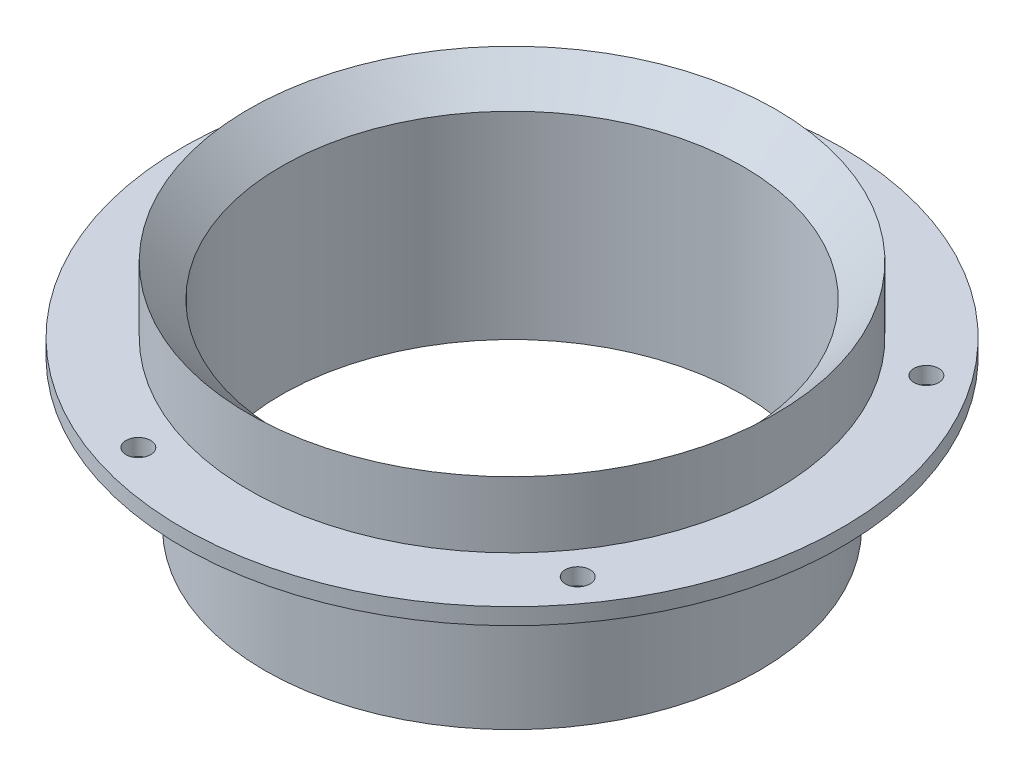
ISO-10303-21;
HEADER;
FILE_DESCRIPTION(('STEP AP214'),'2;1');
FILE_NAME('part.step','',(''),(''),'','','');
FILE_SCHEMA(('AUTOMOTIVE_DESIGN { 1 0 10303 214 1 1 1 1 }'));
ENDSEC;
DATA;
#1=APPLICATION_CONTEXT('core data for automotive mechanical design processes');
#2=APPLICATION_PROTOCOL_DEFINITION('international standard','automotive_design',2000,#1);
#3=PRODUCT_CONTEXT('',#1,'mechanical');
#4=PRODUCT('Part','Part','',(#3));
#5=PRODUCT_RELATED_PRODUCT_CATEGORY('part','',(#4));
#6=PRODUCT_DEFINITION_FORMATION('','',#4);
#7=PRODUCT_DEFINITION_CONTEXT('part definition',#1,'design');
#8=PRODUCT_DEFINITION('design','',#6,#7);
#9=PRODUCT_DEFINITION_SHAPE('','',#8);
#10=(LENGTH_UNIT() NAMED_UNIT(*) SI_UNIT(.MILLI.,.METRE.));
#11=(NAMED_UNIT(*) PLANE_ANGLE_UNIT() SI_UNIT($,.RADIAN.));
#12=(NAMED_UNIT(*) SI_UNIT($,.STERADIAN.) SOLID_ANGLE_UNIT());
#13=UNCERTAINTY_MEASURE_WITH_UNIT(LENGTH_MEASURE(1.E-05),#10,'distance_accuracy_value','');
#14=(GEOMETRIC_REPRESENTATION_CONTEXT(3) GLOBAL_UNCERTAINTY_ASSIGNED_CONTEXT((#13)) GLOBAL_UNIT_ASSIGNED_CONTEXT((#10,
#11,#12)) REPRESENTATION_CONTEXT('',''));
#15=CARTESIAN_POINT('',(0.,0.,0.));
#16=DIRECTION('',(0.,0.,1.));
#17=DIRECTION('',(1.,0.,0.));
#18=AXIS2_PLACEMENT_3D('',#15,#16,#17);
#19=CARTESIAN_POINT('',(-127.,63.5000000000001,0.));
#20=DIRECTION('',(0.,-1.,0.));
#21=DIRECTION('',(0.,0.,-1.));
#22=AXIS2_PLACEMENT_3D('',#19,#20,#21);
#23=PLANE('',#22);
#24=CARTESIAN_POINT('',(-35.3206424570577,63.5000000000001,108.705759812536));
#25=DIRECTION('',(0.,1.,0.));
#26=DIRECTION('',(0.,0.,1.));
#27=AXIS2_PLACEMENT_3D('',#24,#25,#26);
#28=CIRCLE('',#27,4.76250000000002);
#29=CARTESIAN_POINT('',(-35.3206424570577,63.5000000000001,113.468259812536));
#30=VERTEX_POINT('',#29);
#31=EDGE_CURVE('E95',#30,#30,#28,.T.);
#32=ORIENTED_EDGE('',*,*,#31,.F.);
#33=EDGE_LOOP('',(#32));
#34=FACE_BOUND('',#33,.T.);
#35=CARTESIAN_POINT('',(92.4706424570569,63.5000000000001,-67.1838543370292));
#36=DIRECTION('',(0.,1.,0.));
#37=DIRECTION('',(0.,0.,1.));
#38=AXIS2_PLACEMENT_3D('',#35,#36,#37);
#39=CIRCLE('',#38,4.76250000000002);
#40=CARTESIAN_POINT('',(92.4706424570569,63.5000000000001,-62.4213543370292));
#41=VERTEX_POINT('',#40);
#42=EDGE_CURVE('E83',#41,#41,#39,.T.);
#43=ORIENTED_EDGE('',*,*,#42,.F.);
#44=EDGE_LOOP('',(#43));
#45=FACE_BOUND('',#44,.T.);
#46=CARTESIAN_POINT('',(-35.3206424570562,63.5000000000001,-108.705759812536));
#47=DIRECTION('',(0.,1.,0.));
#48=DIRECTION('',(0.,0.,1.));
#49=AXIS2_PLACEMENT_3D('',#46,#47,#48);
#50=CIRCLE('',#49,4.76250000000002);
#51=CARTESIAN_POINT('',(-35.3206424570562,63.5000000000001,-103.943259812536));
#52=VERTEX_POINT('',#51);
#53=EDGE_CURVE('E77',#52,#52,#50,.T.);
#54=ORIENTED_EDGE('',*,*,#53,.F.);
#55=EDGE_LOOP('',(#54));
#56=FACE_BOUND('',#55,.T.);
#57=CARTESIAN_POINT('',(-114.3,63.5000000000001,0.));
#58=DIRECTION('',(0.,1.,0.));
#59=DIRECTION('',(0.,0.,1.));
#60=AXIS2_PLACEMENT_3D('',#57,#58,#59);
#61=CIRCLE('',#60,4.76250000000002);
#62=CARTESIAN_POINT('',(-114.3,63.5000000000001,4.76250000000003));
#63=VERTEX_POINT('',#62);
#64=EDGE_CURVE('E71',#63,#63,#61,.T.);
#65=ORIENTED_EDGE('',*,*,#64,.F.);
#66=EDGE_LOOP('',(#65));
#67=FACE_BOUND('',#66,.T.);
#68=CARTESIAN_POINT('',(0.,63.5000000000001,0.));
#69=DIRECTION('',(0.,-1.,0.));
#70=DIRECTION('',(0.,0.,-1.));
#71=AXIS2_PLACEMENT_3D('',#68,#69,#70);
#72=CIRCLE('',#71,127.);
#73=CARTESIAN_POINT('',(0.,63.5000000000001,-127.));
#74=VERTEX_POINT('',#73);
#75=EDGE_CURVE('E59',#74,#74,#72,.T.);
#76=ORIENTED_EDGE('',*,*,#75,.F.);
#77=EDGE_LOOP('',(#76));
#78=FACE_BOUND('',#77,.T.);
#79=CARTESIAN_POINT('',(0.,63.5000000000001,0.));
#80=DIRECTION('',(0.,-1.,0.));
#81=DIRECTION('',(0.,0.,-1.));
#82=AXIS2_PLACEMENT_3D('',#79,#80,#81);
#83=CIRCLE('',#82,101.6);
#84=CARTESIAN_POINT('',(0.,63.5000000000001,-101.6));
#85=VERTEX_POINT('',#84);
#86=EDGE_CURVE('E62',#85,#85,#83,.T.);
#87=ORIENTED_EDGE('',*,*,#86,.T.);
#88=EDGE_LOOP('',(#87));
#89=FACE_BOUND('',#88,.T.);
#90=CARTESIAN_POINT('',(92.4706424570559,63.5000000000001,67.1838543370305));
#91=DIRECTION('',(0.,1.,0.));
#92=DIRECTION('',(0.,0.,1.));
#93=AXIS2_PLACEMENT_3D('',#90,#91,#92);
#94=CIRCLE('',#93,4.76250000000002);
#95=CARTESIAN_POINT('',(92.4706424570559,63.5000000000001,71.9463543370305));
#96=VERTEX_POINT('',#95);
#97=EDGE_CURVE('E89',#96,#96,#94,.T.);
#98=ORIENTED_EDGE('',*,*,#97,.F.);
#99=EDGE_LOOP('',(#98));
#100=FACE_BOUND('',#99,.T.);
#101=ADVANCED_FACE('F39',(#34,#45,#56,#67,#78,#89,#100),#23,.F.);
#102=CARTESIAN_POINT('',(0.,3.72594235544315,0.));
#103=DIRECTION('',(0.,-1.,0.));
#104=DIRECTION('',(0.,0.,-1.));
#105=AXIS2_PLACEMENT_3D('',#102,#103,#104);
#106=CYLINDRICAL_SURFACE('',#105,88.9);
#107=CARTESIAN_POINT('',(0.,76.2,0.));
#108=DIRECTION('',(0.,-1.,0.));
#109=DIRECTION('',(0.,0.,-1.));
#110=AXIS2_PLACEMENT_3D('',#107,#108,#109);
#111=CIRCLE('',#110,88.9);
#112=CARTESIAN_POINT('',(0.,76.2,-88.9));
#113=VERTEX_POINT('',#112);
#114=EDGE_CURVE('E68',#113,#113,#111,.T.);
#115=ORIENTED_EDGE('',*,*,#114,.F.);
#116=EDGE_LOOP('',(#115));
#117=FACE_BOUND('',#116,.T.);
#118=CARTESIAN_POINT('',(0.,0.,0.));
#119=DIRECTION('',(0.,-1.,0.));
#120=DIRECTION('',(0.,0.,-1.));
#121=AXIS2_PLACEMENT_3D('',#118,#119,#120);
#122=CIRCLE('',#121,88.9);
#123=CARTESIAN_POINT('',(0.,0.,-88.9));
#124=VERTEX_POINT('',#123);
#125=EDGE_CURVE('E10',#124,#124,#122,.T.);
#126=ORIENTED_EDGE('',*,*,#125,.T.);
#127=EDGE_LOOP('',(#126));
#128=FACE_BOUND('',#127,.T.);
#129=ADVANCED_FACE('F41',(#117,#128),#106,.F.);
#130=CARTESIAN_POINT('',(-88.9,0.,0.));
#131=DIRECTION('',(0.,1.,0.));
#132=DIRECTION('',(0.,0.,1.));
#133=AXIS2_PLACEMENT_3D('',#130,#131,#132);
#134=PLANE('',#133);
#135=ORIENTED_EDGE('',*,*,#125,.F.);
#136=EDGE_LOOP('',(#135));
#137=FACE_BOUND('',#136,.T.);
#138=CARTESIAN_POINT('',(0.,0.,0.));
#139=DIRECTION('',(0.,-1.,0.));
#140=DIRECTION('',(0.,0.,-1.));
#141=AXIS2_PLACEMENT_3D('',#138,#139,#140);
#142=CIRCLE('',#141,95.25);
#143=CARTESIAN_POINT('',(0.,0.,-95.25));
#144=VERTEX_POINT('',#143);
#145=EDGE_CURVE('E47',#144,#144,#142,.T.);
#146=ORIENTED_EDGE('',*,*,#145,.T.);
#147=EDGE_LOOP('',(#146));
#148=FACE_BOUND('',#147,.T.);
#149=ADVANCED_FACE('F154',(#137,#148),#134,.F.);
#150=CARTESIAN_POINT('',(0.,3.72594235544315,0.));
#151=DIRECTION('',(0.,-1.,0.));
#152=DIRECTION('',(0.,0.,-1.));
#153=AXIS2_PLACEMENT_3D('',#150,#151,#152);
#154=CYLINDRICAL_SURFACE('',#153,95.25);
#155=ORIENTED_EDGE('',*,*,#145,.F.);
#156=EDGE_LOOP('',(#155));
#157=FACE_BOUND('',#156,.T.);
#158=CARTESIAN_POINT('',(0.,57.1500000000001,0.));
#159=DIRECTION('',(0.,-1.,0.));
#160=DIRECTION('',(0.,0.,-1.));
#161=AXIS2_PLACEMENT_3D('',#158,#159,#160);
#162=CIRCLE('',#161,95.25);
#163=CARTESIAN_POINT('',(0.,57.1500000000001,-95.25));
#164=VERTEX_POINT('',#163);
#165=EDGE_CURVE('E51',#164,#164,#162,.T.);
#166=ORIENTED_EDGE('',*,*,#165,.T.);
#167=EDGE_LOOP('',(#166));
#168=FACE_BOUND('',#167,.T.);
#169=ADVANCED_FACE('F128',(#157,#168),#154,.T.);
#170=CARTESIAN_POINT('',(-95.25,57.1500000000001,0.));
#171=DIRECTION('',(0.,1.,0.));
#172=DIRECTION('',(0.,0.,1.));
#173=AXIS2_PLACEMENT_3D('',#170,#171,#172);
#174=PLANE('',#173);
#175=CARTESIAN_POINT('',(-35.3206424570577,57.1500000000001,108.705759812536));
#176=DIRECTION('',(0.,1.,0.));
#177=DIRECTION('',(0.,0.,1.));
#178=AXIS2_PLACEMENT_3D('',#175,#176,#177);
#179=CIRCLE('',#178,4.76250000000001);
#180=CARTESIAN_POINT('',(-35.3206424570577,57.1500000000001,113.468259812536));
#181=VERTEX_POINT('',#180);
#182=EDGE_CURVE('E92',#181,#181,#179,.T.);
#183=ORIENTED_EDGE('',*,*,#182,.T.);
#184=EDGE_LOOP('',(#183));
#185=FACE_BOUND('',#184,.T.);
#186=CARTESIAN_POINT('',(92.4706424570559,57.1500000000001,67.1838543370305));
#187=DIRECTION('',(0.,1.,0.));
#188=DIRECTION('',(0.,0.,1.));
#189=AXIS2_PLACEMENT_3D('',#186,#187,#188);
#190=CIRCLE('',#189,4.76250000000001);
#191=CARTESIAN_POINT('',(92.4706424570559,57.1500000000001,71.9463543370305));
#192=VERTEX_POINT('',#191);
#193=EDGE_CURVE('E86',#192,#192,#190,.T.);
#194=ORIENTED_EDGE('',*,*,#193,.T.);
#195=EDGE_LOOP('',(#194));
#196=FACE_BOUND('',#195,.T.);
#197=CARTESIAN_POINT('',(92.4706424570569,57.1500000000001,-67.1838543370292));
#198=DIRECTION('',(0.,1.,0.));
#199=DIRECTION('',(0.,0.,1.));
#200=AXIS2_PLACEMENT_3D('',#197,#198,#199);
#201=CIRCLE('',#200,4.76250000000001);
#202=CARTESIAN_POINT('',(92.4706424570569,57.1500000000001,-62.4213543370292));
#203=VERTEX_POINT('',#202);
#204=EDGE_CURVE('E80',#203,#203,#201,.T.);
#205=ORIENTED_EDGE('',*,*,#204,.T.);
#206=EDGE_LOOP('',(#205));
#207=FACE_BOUND('',#206,.T.);
#208=CARTESIAN_POINT('',(-35.3206424570562,57.1500000000001,-108.705759812536));
#209=DIRECTION('',(0.,1.,0.));
#210=DIRECTION('',(0.,0.,1.));
#211=AXIS2_PLACEMENT_3D('',#208,#209,#210);
#212=CIRCLE('',#211,4.76250000000001);
#213=CARTESIAN_POINT('',(-35.3206424570562,57.1500000000001,-103.943259812536));
#214=VERTEX_POINT('',#213);
#215=EDGE_CURVE('E74',#214,#214,#212,.T.);
#216=ORIENTED_EDGE('',*,*,#215,.T.);
#217=EDGE_LOOP('',(#216));
#218=FACE_BOUND('',#217,.T.);
#219=CARTESIAN_POINT('',(-114.3,57.1500000000001,0.));
#220=DIRECTION('',(0.,1.,0.));
#221=DIRECTION('',(0.,0.,1.));
#222=AXIS2_PLACEMENT_3D('',#219,#220,#221);
#223=CIRCLE('',#222,4.76250000000001);
#224=CARTESIAN_POINT('',(-114.3,57.1500000000001,4.76250000000002));
#225=VERTEX_POINT('',#224);
#226=EDGE_CURVE('E43',#225,#225,#223,.T.);
#227=ORIENTED_EDGE('',*,*,#226,.T.);
#228=EDGE_LOOP('',(#227));
#229=FACE_BOUND('',#228,.T.);
#230=ORIENTED_EDGE('',*,*,#165,.F.);
#231=EDGE_LOOP('',(#230));
#232=FACE_BOUND('',#231,.T.);
#233=CARTESIAN_POINT('',(0.,57.1500000000001,0.));
#234=DIRECTION('',(0.,-1.,0.));
#235=DIRECTION('',(0.,0.,-1.));
#236=AXIS2_PLACEMENT_3D('',#233,#234,#235);
#237=CIRCLE('',#236,127.);
#238=CARTESIAN_POINT('',(0.,57.1500000000001,-127.));
#239=VERTEX_POINT('',#238);
#240=EDGE_CURVE('E56',#239,#239,#237,.T.);
#241=ORIENTED_EDGE('',*,*,#240,.T.);
#242=EDGE_LOOP('',(#241));
#243=FACE_BOUND('',#242,.T.);
#244=ADVANCED_FACE('F124',(#185,#196,#207,#218,#229,#232,#243),#174,.F.);
#245=CARTESIAN_POINT('',(0.,3.72594235544315,0.));
#246=DIRECTION('',(0.,-1.,0.));
#247=DIRECTION('',(0.,0.,-1.));
#248=AXIS2_PLACEMENT_3D('',#245,#246,#247);
#249=CYLINDRICAL_SURFACE('',#248,127.);
#250=ORIENTED_EDGE('',*,*,#240,.F.);
#251=EDGE_LOOP('',(#250));
#252=FACE_BOUND('',#251,.T.);
#253=ORIENTED_EDGE('',*,*,#75,.T.);
#254=EDGE_LOOP('',(#253));
#255=FACE_BOUND('',#254,.T.);
#256=ADVANCED_FACE('F127',(#252,#255),#249,.T.);
#257=CARTESIAN_POINT('',(0.,3.72594235544315,0.));
#258=DIRECTION('',(0.,-1.,0.));
#259=DIRECTION('',(0.,0.,-1.));
#260=AXIS2_PLACEMENT_3D('',#257,#258,#259);
#261=CYLINDRICAL_SURFACE('',#260,101.6);
#262=ORIENTED_EDGE('',*,*,#86,.F.);
#263=EDGE_LOOP('',(#262));
#264=FACE_BOUND('',#263,.T.);
#265=CARTESIAN_POINT('',(0.,88.9000000000001,0.));
#266=DIRECTION('',(0.,-1.,0.));
#267=DIRECTION('',(0.,0.,-1.));
#268=AXIS2_PLACEMENT_3D('',#265,#266,#267);
#269=CIRCLE('',#268,101.6);
#270=CARTESIAN_POINT('',(0.,88.9000000000001,-101.6));
#271=VERTEX_POINT('',#270);
#272=EDGE_CURVE('E65',#271,#271,#269,.T.);
#273=ORIENTED_EDGE('',*,*,#272,.T.);
#274=EDGE_LOOP('',(#273));
#275=FACE_BOUND('',#274,.T.);
#276=ADVANCED_FACE('F144',(#264,#275),#261,.T.);
#277=CARTESIAN_POINT('',(0.,76.2,0.));
#278=DIRECTION('',(0.,1.,0.));
#279=DIRECTION('',(0.,0.,1.));
#280=AXIS2_PLACEMENT_3D('',#277,#278,#279);
#281=CONICAL_SURFACE('',#280,88.9,0.785398163397444);
#282=ORIENTED_EDGE('',*,*,#272,.F.);
#283=EDGE_LOOP('',(#282));
#284=FACE_BOUND('',#283,.T.);
#285=ORIENTED_EDGE('',*,*,#114,.T.);
#286=EDGE_LOOP('',(#285));
#287=FACE_BOUND('',#286,.T.);
#288=ADVANCED_FACE('F150',(#284,#287),#281,.F.);
#289=CARTESIAN_POINT('',(-114.3,63.5000000000001,0.));
#290=DIRECTION('',(0.,1.,0.));
#291=DIRECTION('',(0.,0.,1.));
#292=AXIS2_PLACEMENT_3D('',#289,#290,#291);
#293=CYLINDRICAL_SURFACE('',#292,4.76250000000001);
#294=ORIENTED_EDGE('',*,*,#64,.T.);
#295=EDGE_LOOP('',(#294));
#296=FACE_BOUND('',#295,.T.);
#297=ORIENTED_EDGE('',*,*,#226,.F.);
#298=EDGE_LOOP('',(#297));
#299=FACE_BOUND('',#298,.T.);
#300=ADVANCED_FACE('F170',(#296,#299),#293,.F.);
#301=CARTESIAN_POINT('',(-35.3206424570562,63.5000000000001,-108.705759812536));
#302=DIRECTION('',(0.,1.,0.));
#303=DIRECTION('',(0.,0.,1.));
#304=AXIS2_PLACEMENT_3D('',#301,#302,#303);
#305=CYLINDRICAL_SURFACE('',#304,4.76250000000001);
#306=ORIENTED_EDGE('',*,*,#53,.T.);
#307=EDGE_LOOP('',(#306));
#308=FACE_BOUND('',#307,.T.);
#309=ORIENTED_EDGE('',*,*,#215,.F.);
#310=EDGE_LOOP('',(#309));
#311=FACE_BOUND('',#310,.T.);
#312=ADVANCED_FACE('F176',(#308,#311),#305,.F.);
#313=CARTESIAN_POINT('',(92.4706424570569,63.5000000000001,-67.1838543370292));
#314=DIRECTION('',(0.,1.,0.));
#315=DIRECTION('',(0.,0.,1.));
#316=AXIS2_PLACEMENT_3D('',#313,#314,#315);
#317=CYLINDRICAL_SURFACE('',#316,4.76250000000001);
#318=ORIENTED_EDGE('',*,*,#42,.T.);
#319=EDGE_LOOP('',(#318));
#320=FACE_BOUND('',#319,.T.);
#321=ORIENTED_EDGE('',*,*,#204,.F.);
#322=EDGE_LOOP('',(#321));
#323=FACE_BOUND('',#322,.T.);
#324=ADVANCED_FACE('F120',(#320,#323),#317,.F.);
#325=CARTESIAN_POINT('',(92.4706424570559,63.5000000000001,67.1838543370305));
#326=DIRECTION('',(0.,1.,0.));
#327=DIRECTION('',(0.,0.,1.));
#328=AXIS2_PLACEMENT_3D('',#325,#326,#327);
#329=CYLINDRICAL_SURFACE('',#328,4.76250000000001);
#330=ORIENTED_EDGE('',*,*,#97,.T.);
#331=EDGE_LOOP('',(#330));
#332=FACE_BOUND('',#331,.T.);
#333=ORIENTED_EDGE('',*,*,#193,.F.);
#334=EDGE_LOOP('',(#333));
#335=FACE_BOUND('',#334,.T.);
#336=ADVANCED_FACE('F117',(#332,#335),#329,.F.);
#337=CARTESIAN_POINT('',(-35.3206424570577,63.5000000000001,108.705759812536));
#338=DIRECTION('',(0.,1.,0.));
#339=DIRECTION('',(0.,0.,1.));
#340=AXIS2_PLACEMENT_3D('',#337,#338,#339);
#341=CYLINDRICAL_SURFACE('',#340,4.76250000000001);
#342=ORIENTED_EDGE('',*,*,#31,.T.);
#343=EDGE_LOOP('',(#342));
#344=FACE_BOUND('',#343,.T.);
#345=ORIENTED_EDGE('',*,*,#182,.F.);
#346=EDGE_LOOP('',(#345));
#347=FACE_BOUND('',#346,.T.);
#348=ADVANCED_FACE('F99',(#344,#347),#341,.F.);
#349=CLOSED_SHELL('',(#101,#129,#149,#169,#244,#256,#276,#288,#300,#312,#324,#336,#348));
#350=MANIFOLD_SOLID_BREP('B2',#349);
#351=ADVANCED_BREP_SHAPE_REPRESENTATION('',(#18,#350),#14);
#352=SHAPE_DEFINITION_REPRESENTATION(#9,#351);
ENDSEC;
END-ISO-10303-21;
